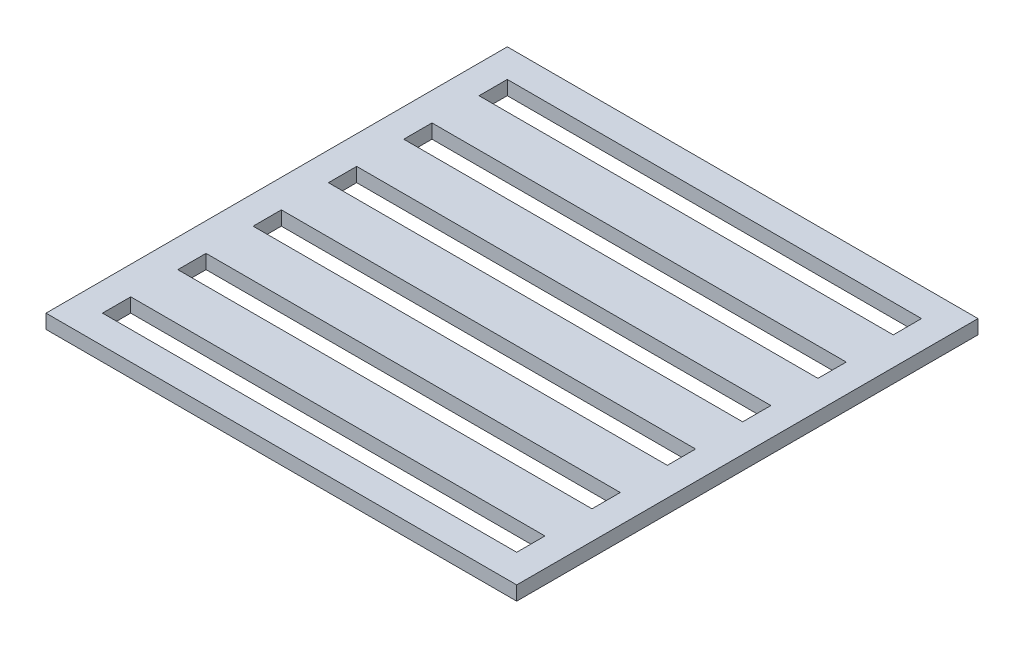
ISO-10303-21;
HEADER;
FILE_DESCRIPTION(('STEP AP214'),'2;1');
FILE_NAME('part.step','',(''),(''),'','','');
FILE_SCHEMA(('AUTOMOTIVE_DESIGN { 1 0 10303 214 1 1 1 1 }'));
ENDSEC;
DATA;
#1=APPLICATION_CONTEXT('core data for automotive mechanical design processes');
#2=APPLICATION_PROTOCOL_DEFINITION('international standard','automotive_design',2000,#1);
#3=PRODUCT_CONTEXT('',#1,'mechanical');
#4=PRODUCT('Part','Part','',(#3));
#5=PRODUCT_RELATED_PRODUCT_CATEGORY('part','',(#4));
#6=PRODUCT_DEFINITION_FORMATION('','',#4);
#7=PRODUCT_DEFINITION_CONTEXT('part definition',#1,'design');
#8=PRODUCT_DEFINITION('design','',#6,#7);
#9=PRODUCT_DEFINITION_SHAPE('','',#8);
#10=(LENGTH_UNIT() NAMED_UNIT(*) SI_UNIT(.MILLI.,.METRE.));
#11=(NAMED_UNIT(*) PLANE_ANGLE_UNIT() SI_UNIT($,.RADIAN.));
#12=(NAMED_UNIT(*) SI_UNIT($,.STERADIAN.) SOLID_ANGLE_UNIT());
#13=UNCERTAINTY_MEASURE_WITH_UNIT(LENGTH_MEASURE(1.E-05),#10,'distance_accuracy_value','');
#14=(GEOMETRIC_REPRESENTATION_CONTEXT(3) GLOBAL_UNCERTAINTY_ASSIGNED_CONTEXT((#13)) GLOBAL_UNIT_ASSIGNED_CONTEXT((#10,
#11,#12)) REPRESENTATION_CONTEXT('',''));
#15=CARTESIAN_POINT('',(0.,0.,0.));
#16=DIRECTION('',(0.,0.,1.));
#17=DIRECTION('',(1.,0.,0.));
#18=AXIS2_PLACEMENT_3D('',#15,#16,#17);
#19=CARTESIAN_POINT('',(500.,-7.50000000000003,245.));
#20=DIRECTION('',(0.,0.,-1.));
#21=DIRECTION('',(-1.,0.,0.));
#22=AXIS2_PLACEMENT_3D('',#19,#20,#21);
#23=PLANE('',#22);
#24=DIRECTION('',(0.,-1.,0.));
#25=VECTOR('',#24,1.);
#26=CARTESIAN_POINT('',(0.,-7.50000000000003,245.));
#27=LINE('',#26,#25);
#28=CARTESIAN_POINT('',(0.,7.49999999999997,245.));
#29=VERTEX_POINT('',#28);
#30=CARTESIAN_POINT('',(0.,-7.50000000000003,245.));
#31=VERTEX_POINT('',#30);
#32=EDGE_CURVE('E276',#29,#31,#27,.T.);
#33=ORIENTED_EDGE('',*,*,#32,.T.);
#34=DIRECTION('',(-1.,0.,0.));
#35=VECTOR('',#34,1.);
#36=CARTESIAN_POINT('',(500.,-7.50000000000003,245.));
#37=LINE('',#36,#35);
#38=CARTESIAN_POINT('',(500.,-7.50000000000003,245.));
#39=VERTEX_POINT('',#38);
#40=EDGE_CURVE('E11',#39,#31,#37,.T.);
#41=ORIENTED_EDGE('',*,*,#40,.F.);
#42=DIRECTION('',(0.,-1.,0.));
#43=VECTOR('',#42,1.);
#44=CARTESIAN_POINT('',(500.,-7.50000000000003,245.));
#45=LINE('',#44,#43);
#46=CARTESIAN_POINT('',(500.,7.49999999999997,245.));
#47=VERTEX_POINT('',#46);
#48=EDGE_CURVE('E499',#47,#39,#45,.T.);
#49=ORIENTED_EDGE('',*,*,#48,.F.);
#50=DIRECTION('',(-1.,0.,0.));
#51=VECTOR('',#50,1.);
#52=CARTESIAN_POINT('',(500.,7.49999999999997,245.));
#53=LINE('',#52,#51);
#54=EDGE_CURVE('E513',#47,#29,#53,.T.);
#55=ORIENTED_EDGE('',*,*,#54,.T.);
#56=EDGE_LOOP('',(#33,#41,#49,#55));
#57=FACE_BOUND('',#56,.T.);
#58=ADVANCED_FACE('F43',(#57),#23,.F.);
#59=CARTESIAN_POINT('',(500.,-7.49999999999997,-245.));
#60=DIRECTION('',(0.,1.,0.));
#61=DIRECTION('',(0.,0.,1.));
#62=AXIS2_PLACEMENT_3D('',#59,#60,#61);
#63=PLANE('',#62);
#64=DIRECTION('',(1.,0.,0.));
#65=VECTOR('',#64,1.);
#66=CARTESIAN_POINT('',(30.,-7.49999999999998,-185.));
#67=LINE('',#66,#65);
#68=CARTESIAN_POINT('',(30.,-7.49999999999998,-185.));
#69=VERTEX_POINT('',#68);
#70=CARTESIAN_POINT('',(470.,-7.49999999999998,-185.));
#71=VERTEX_POINT('',#70);
#72=EDGE_CURVE('E241',#69,#71,#67,.T.);
#73=ORIENTED_EDGE('',*,*,#72,.T.);
#74=DIRECTION('',(0.,0.,-1.));
#75=VECTOR('',#74,1.);
#76=CARTESIAN_POINT('',(470.,-7.49999999999998,-185.));
#77=LINE('',#76,#75);
#78=CARTESIAN_POINT('',(470.,-7.49999999999997,-215.));
#79=VERTEX_POINT('',#78);
#80=EDGE_CURVE('E232',#71,#79,#77,.T.);
#81=ORIENTED_EDGE('',*,*,#80,.T.);
#82=DIRECTION('',(-1.,0.,0.));
#83=VECTOR('',#82,1.);
#84=CARTESIAN_POINT('',(30.,-7.49999999999997,-215.));
#85=LINE('',#84,#83);
#86=CARTESIAN_POINT('',(30.,-7.49999999999997,-215.));
#87=VERTEX_POINT('',#86);
#88=EDGE_CURVE('E244',#79,#87,#85,.T.);
#89=ORIENTED_EDGE('',*,*,#88,.T.);
#90=DIRECTION('',(0.,0.,1.));
#91=VECTOR('',#90,1.);
#92=CARTESIAN_POINT('',(30.,-7.49999999999998,-185.));
#93=LINE('',#92,#91);
#94=EDGE_CURVE('E58',#87,#69,#93,.T.);
#95=ORIENTED_EDGE('',*,*,#94,.T.);
#96=EDGE_LOOP('',(#73,#81,#89,#95));
#97=FACE_BOUND('',#96,.T.);
#98=DIRECTION('',(-1.,0.,0.));
#99=VECTOR('',#98,1.);
#100=CARTESIAN_POINT('',(470.,-7.49999999999998,-135.));
#101=LINE('',#100,#99);
#102=CARTESIAN_POINT('',(470.,-7.49999999999998,-135.));
#103=VERTEX_POINT('',#102);
#104=CARTESIAN_POINT('',(30.,-7.49999999999998,-135.));
#105=VERTEX_POINT('',#104);
#106=EDGE_CURVE('E286',#103,#105,#101,.T.);
#107=ORIENTED_EDGE('',*,*,#106,.T.);
#108=DIRECTION('',(0.,0.,1.));
#109=VECTOR('',#108,1.);
#110=CARTESIAN_POINT('',(30.,-7.49999999999999,-105.));
#111=LINE('',#110,#109);
#112=CARTESIAN_POINT('',(30.,-7.49999999999999,-105.));
#113=VERTEX_POINT('',#112);
#114=EDGE_CURVE('E302',#105,#113,#111,.T.);
#115=ORIENTED_EDGE('',*,*,#114,.T.);
#116=DIRECTION('',(1.,0.,0.));
#117=VECTOR('',#116,1.);
#118=CARTESIAN_POINT('',(470.,-7.49999999999999,-105.));
#119=LINE('',#118,#117);
#120=CARTESIAN_POINT('',(470.,-7.49999999999999,-105.));
#121=VERTEX_POINT('',#120);
#122=EDGE_CURVE('E317',#113,#121,#119,.T.);
#123=ORIENTED_EDGE('',*,*,#122,.T.);
#124=DIRECTION('',(0.,0.,-1.));
#125=VECTOR('',#124,1.);
#126=CARTESIAN_POINT('',(470.,-7.49999999999999,-105.));
#127=LINE('',#126,#125);
#128=EDGE_CURVE('E66',#121,#103,#127,.T.);
#129=ORIENTED_EDGE('',*,*,#128,.T.);
#130=EDGE_LOOP('',(#107,#115,#123,#129));
#131=FACE_BOUND('',#130,.T.);
#132=DIRECTION('',(-1.,0.,0.));
#133=VECTOR('',#132,1.);
#134=CARTESIAN_POINT('',(470.,-7.49999999999999,-55.));
#135=LINE('',#134,#133);
#136=CARTESIAN_POINT('',(470.,-7.49999999999999,-55.));
#137=VERTEX_POINT('',#136);
#138=CARTESIAN_POINT('',(30.,-7.49999999999999,-55.));
#139=VERTEX_POINT('',#138);
#140=EDGE_CURVE('E328',#137,#139,#135,.T.);
#141=ORIENTED_EDGE('',*,*,#140,.T.);
#142=DIRECTION('',(0.,0.,1.));
#143=VECTOR('',#142,1.);
#144=CARTESIAN_POINT('',(30.,-7.5,-25.));
#145=LINE('',#144,#143);
#146=CARTESIAN_POINT('',(30.,-7.5,-25.));
#147=VERTEX_POINT('',#146);
#148=EDGE_CURVE('E344',#139,#147,#145,.T.);
#149=ORIENTED_EDGE('',*,*,#148,.T.);
#150=DIRECTION('',(1.,0.,0.));
#151=VECTOR('',#150,1.);
#152=CARTESIAN_POINT('',(470.,-7.5,-25.));
#153=LINE('',#152,#151);
#154=CARTESIAN_POINT('',(470.,-7.5,-25.));
#155=VERTEX_POINT('',#154);
#156=EDGE_CURVE('E361',#147,#155,#153,.T.);
#157=ORIENTED_EDGE('',*,*,#156,.T.);
#158=DIRECTION('',(0.,0.,-1.));
#159=VECTOR('',#158,1.);
#160=CARTESIAN_POINT('',(470.,-7.5,-25.));
#161=LINE('',#160,#159);
#162=EDGE_CURVE('E357',#155,#137,#161,.T.);
#163=ORIENTED_EDGE('',*,*,#162,.T.);
#164=EDGE_LOOP('',(#141,#149,#157,#163));
#165=FACE_BOUND('',#164,.T.);
#166=DIRECTION('',(-1.,0.,0.));
#167=VECTOR('',#166,1.);
#168=CARTESIAN_POINT('',(470.,-7.5,25.));
#169=LINE('',#168,#167);
#170=CARTESIAN_POINT('',(470.,-7.5,25.));
#171=VERTEX_POINT('',#170);
#172=CARTESIAN_POINT('',(30.,-7.5,25.));
#173=VERTEX_POINT('',#172);
#174=EDGE_CURVE('E372',#171,#173,#169,.T.);
#175=ORIENTED_EDGE('',*,*,#174,.T.);
#176=DIRECTION('',(0.,0.,1.));
#177=VECTOR('',#176,1.);
#178=CARTESIAN_POINT('',(30.,-7.50000000000001,55.));
#179=LINE('',#178,#177);
#180=CARTESIAN_POINT('',(30.,-7.50000000000001,55.));
#181=VERTEX_POINT('',#180);
#182=EDGE_CURVE('E388',#173,#181,#179,.T.);
#183=ORIENTED_EDGE('',*,*,#182,.T.);
#184=DIRECTION('',(1.,0.,0.));
#185=VECTOR('',#184,1.);
#186=CARTESIAN_POINT('',(470.,-7.50000000000001,55.));
#187=LINE('',#186,#185);
#188=CARTESIAN_POINT('',(470.,-7.50000000000001,55.));
#189=VERTEX_POINT('',#188);
#190=EDGE_CURVE('E405',#181,#189,#187,.T.);
#191=ORIENTED_EDGE('',*,*,#190,.T.);
#192=DIRECTION('',(0.,0.,-1.));
#193=VECTOR('',#192,1.);
#194=CARTESIAN_POINT('',(470.,-7.50000000000001,55.));
#195=LINE('',#194,#193);
#196=EDGE_CURVE('E401',#189,#171,#195,.T.);
#197=ORIENTED_EDGE('',*,*,#196,.T.);
#198=EDGE_LOOP('',(#175,#183,#191,#197));
#199=FACE_BOUND('',#198,.T.);
#200=DIRECTION('',(-1.,0.,0.));
#201=VECTOR('',#200,1.);
#202=CARTESIAN_POINT('',(470.,-7.50000000000001,105.));
#203=LINE('',#202,#201);
#204=CARTESIAN_POINT('',(470.,-7.50000000000001,105.));
#205=VERTEX_POINT('',#204);
#206=CARTESIAN_POINT('',(30.,-7.50000000000001,105.));
#207=VERTEX_POINT('',#206);
#208=EDGE_CURVE('E416',#205,#207,#203,.T.);
#209=ORIENTED_EDGE('',*,*,#208,.T.);
#210=DIRECTION('',(0.,0.,1.));
#211=VECTOR('',#210,1.);
#212=CARTESIAN_POINT('',(30.,-7.50000000000002,135.));
#213=LINE('',#212,#211);
#214=CARTESIAN_POINT('',(30.,-7.50000000000002,135.));
#215=VERTEX_POINT('',#214);
#216=EDGE_CURVE('E432',#207,#215,#213,.T.);
#217=ORIENTED_EDGE('',*,*,#216,.T.);
#218=DIRECTION('',(1.,0.,0.));
#219=VECTOR('',#218,1.);
#220=CARTESIAN_POINT('',(470.,-7.50000000000002,135.));
#221=LINE('',#220,#219);
#222=CARTESIAN_POINT('',(470.,-7.50000000000002,135.));
#223=VERTEX_POINT('',#222);
#224=EDGE_CURVE('E449',#215,#223,#221,.T.);
#225=ORIENTED_EDGE('',*,*,#224,.T.);
#226=DIRECTION('',(0.,0.,-1.));
#227=VECTOR('',#226,1.);
#228=CARTESIAN_POINT('',(470.,-7.50000000000002,135.));
#229=LINE('',#228,#227);
#230=EDGE_CURVE('E445',#223,#205,#229,.T.);
#231=ORIENTED_EDGE('',*,*,#230,.T.);
#232=EDGE_LOOP('',(#209,#217,#225,#231));
#233=FACE_BOUND('',#232,.T.);
#234=DIRECTION('',(-1.,0.,0.));
#235=VECTOR('',#234,1.);
#236=CARTESIAN_POINT('',(470.,-7.50000000000002,185.));
#237=LINE('',#236,#235);
#238=CARTESIAN_POINT('',(470.,-7.50000000000002,185.));
#239=VERTEX_POINT('',#238);
#240=CARTESIAN_POINT('',(30.,-7.50000000000002,185.));
#241=VERTEX_POINT('',#240);
#242=EDGE_CURVE('E460',#239,#241,#237,.T.);
#243=ORIENTED_EDGE('',*,*,#242,.T.);
#244=DIRECTION('',(0.,0.,1.));
#245=VECTOR('',#244,1.);
#246=CARTESIAN_POINT('',(30.,-7.50000000000003,215.));
#247=LINE('',#246,#245);
#248=CARTESIAN_POINT('',(30.,-7.50000000000003,215.));
#249=VERTEX_POINT('',#248);
#250=EDGE_CURVE('E475',#241,#249,#247,.T.);
#251=ORIENTED_EDGE('',*,*,#250,.T.);
#252=DIRECTION('',(1.,0.,0.));
#253=VECTOR('',#252,1.);
#254=CARTESIAN_POINT('',(470.,-7.50000000000003,215.));
#255=LINE('',#254,#253);
#256=CARTESIAN_POINT('',(470.,-7.50000000000003,215.));
#257=VERTEX_POINT('',#256);
#258=EDGE_CURVE('E492',#249,#257,#255,.T.);
#259=ORIENTED_EDGE('',*,*,#258,.T.);
#260=DIRECTION('',(0.,0.,-1.));
#261=VECTOR('',#260,1.);
#262=CARTESIAN_POINT('',(470.,-7.50000000000003,215.));
#263=LINE('',#262,#261);
#264=EDGE_CURVE('E488',#257,#239,#263,.T.);
#265=ORIENTED_EDGE('',*,*,#264,.T.);
#266=EDGE_LOOP('',(#243,#251,#259,#265));
#267=FACE_BOUND('',#266,.T.);
#268=DIRECTION('',(0.,0.,-1.));
#269=VECTOR('',#268,1.);
#270=CARTESIAN_POINT('',(0.,-7.49999999999997,-245.));
#271=LINE('',#270,#269);
#272=CARTESIAN_POINT('',(0.,-7.49999999999997,-245.));
#273=VERTEX_POINT('',#272);
#274=EDGE_CURVE('E517',#31,#273,#271,.T.);
#275=ORIENTED_EDGE('',*,*,#274,.T.);
#276=DIRECTION('',(-1.,0.,0.));
#277=VECTOR('',#276,1.);
#278=CARTESIAN_POINT('',(500.,-7.49999999999997,-245.));
#279=LINE('',#278,#277);
#280=CARTESIAN_POINT('',(500.,-7.49999999999997,-245.));
#281=VERTEX_POINT('',#280);
#282=EDGE_CURVE('E51',#281,#273,#279,.T.);
#283=ORIENTED_EDGE('',*,*,#282,.F.);
#284=DIRECTION('',(0.,0.,-1.));
#285=VECTOR('',#284,1.);
#286=CARTESIAN_POINT('',(500.,-7.49999999999997,-245.));
#287=LINE('',#286,#285);
#288=EDGE_CURVE('E503',#39,#281,#287,.T.);
#289=ORIENTED_EDGE('',*,*,#288,.F.);
#290=ORIENTED_EDGE('',*,*,#40,.T.);
#291=EDGE_LOOP('',(#275,#283,#289,#290));
#292=FACE_BOUND('',#291,.T.);
#293=ADVANCED_FACE('F249',(#97,#131,#165,#199,#233,#267,#292),#63,.F.);
#294=CARTESIAN_POINT('',(500.,-7.49999999999997,-245.));
#295=DIRECTION('',(0.,0.,1.));
#296=DIRECTION('',(1.,0.,0.));
#297=AXIS2_PLACEMENT_3D('',#294,#295,#296);
#298=PLANE('',#297);
#299=DIRECTION('',(0.,1.,0.));
#300=VECTOR('',#299,1.);
#301=CARTESIAN_POINT('',(0.,-7.49999999999997,-245.));
#302=LINE('',#301,#300);
#303=CARTESIAN_POINT('',(0.,7.50000000000003,-245.));
#304=VERTEX_POINT('',#303);
#305=EDGE_CURVE('E520',#273,#304,#302,.T.);
#306=ORIENTED_EDGE('',*,*,#305,.T.);
#307=DIRECTION('',(-1.,0.,0.));
#308=VECTOR('',#307,1.);
#309=CARTESIAN_POINT('',(500.,7.50000000000003,-245.));
#310=LINE('',#309,#308);
#311=CARTESIAN_POINT('',(500.,7.50000000000003,-245.));
#312=VERTEX_POINT('',#311);
#313=EDGE_CURVE('E528',#312,#304,#310,.T.);
#314=ORIENTED_EDGE('',*,*,#313,.F.);
#315=DIRECTION('',(0.,1.,0.));
#316=VECTOR('',#315,1.);
#317=CARTESIAN_POINT('',(500.,-7.49999999999997,-245.));
#318=LINE('',#317,#316);
#319=EDGE_CURVE('E507',#281,#312,#318,.T.);
#320=ORIENTED_EDGE('',*,*,#319,.F.);
#321=ORIENTED_EDGE('',*,*,#282,.T.);
#322=EDGE_LOOP('',(#306,#314,#320,#321));
#323=FACE_BOUND('',#322,.T.);
#324=ADVANCED_FACE('F537',(#323),#298,.F.);
#325=CARTESIAN_POINT('',(500.,7.50000000000003,-245.));
#326=DIRECTION('',(0.,-1.,0.));
#327=DIRECTION('',(0.,0.,-1.));
#328=AXIS2_PLACEMENT_3D('',#325,#326,#327);
#329=PLANE('',#328);
#330=DIRECTION('',(-1.,0.,0.));
#331=VECTOR('',#330,1.);
#332=CARTESIAN_POINT('',(30.,7.50000000000003,-215.));
#333=LINE('',#332,#331);
#334=CARTESIAN_POINT('',(470.,7.50000000000003,-215.));
#335=VERTEX_POINT('',#334);
#336=CARTESIAN_POINT('',(30.,7.50000000000003,-215.));
#337=VERTEX_POINT('',#336);
#338=EDGE_CURVE('E266',#335,#337,#333,.T.);
#339=ORIENTED_EDGE('',*,*,#338,.F.);
#340=DIRECTION('',(0.,0.,-1.));
#341=VECTOR('',#340,1.);
#342=CARTESIAN_POINT('',(470.,7.50000000000002,-185.));
#343=LINE('',#342,#341);
#344=CARTESIAN_POINT('',(470.,7.50000000000002,-185.));
#345=VERTEX_POINT('',#344);
#346=EDGE_CURVE('E235',#345,#335,#343,.T.);
#347=ORIENTED_EDGE('',*,*,#346,.F.);
#348=DIRECTION('',(1.,0.,0.));
#349=VECTOR('',#348,1.);
#350=CARTESIAN_POINT('',(30.,7.50000000000002,-185.));
#351=LINE('',#350,#349);
#352=CARTESIAN_POINT('',(30.,7.50000000000002,-185.));
#353=VERTEX_POINT('',#352);
#354=EDGE_CURVE('E253',#353,#345,#351,.T.);
#355=ORIENTED_EDGE('',*,*,#354,.F.);
#356=DIRECTION('',(0.,0.,1.));
#357=VECTOR('',#356,1.);
#358=CARTESIAN_POINT('',(30.,7.50000000000002,-185.));
#359=LINE('',#358,#357);
#360=EDGE_CURVE('E257',#337,#353,#359,.T.);
#361=ORIENTED_EDGE('',*,*,#360,.F.);
#362=EDGE_LOOP('',(#339,#347,#355,#361));
#363=FACE_BOUND('',#362,.T.);
#364=DIRECTION('',(1.,0.,0.));
#365=VECTOR('',#364,1.);
#366=CARTESIAN_POINT('',(470.,7.50000000000001,-105.));
#367=LINE('',#366,#365);
#368=CARTESIAN_POINT('',(30.,7.50000000000001,-105.));
#369=VERTEX_POINT('',#368);
#370=CARTESIAN_POINT('',(470.,7.50000000000001,-105.));
#371=VERTEX_POINT('',#370);
#372=EDGE_CURVE('E306',#369,#371,#367,.T.);
#373=ORIENTED_EDGE('',*,*,#372,.F.);
#374=DIRECTION('',(0.,0.,1.));
#375=VECTOR('',#374,1.);
#376=CARTESIAN_POINT('',(30.,7.50000000000001,-105.));
#377=LINE('',#376,#375);
#378=CARTESIAN_POINT('',(30.,7.50000000000002,-135.));
#379=VERTEX_POINT('',#378);
#380=EDGE_CURVE('E267',#379,#369,#377,.T.);
#381=ORIENTED_EDGE('',*,*,#380,.F.);
#382=DIRECTION('',(-1.,0.,0.));
#383=VECTOR('',#382,1.);
#384=CARTESIAN_POINT('',(470.,7.50000000000002,-135.));
#385=LINE('',#384,#383);
#386=CARTESIAN_POINT('',(470.,7.50000000000002,-135.));
#387=VERTEX_POINT('',#386);
#388=EDGE_CURVE('E297',#387,#379,#385,.T.);
#389=ORIENTED_EDGE('',*,*,#388,.F.);
#390=DIRECTION('',(0.,0.,-1.));
#391=VECTOR('',#390,1.);
#392=CARTESIAN_POINT('',(470.,7.50000000000001,-105.));
#393=LINE('',#392,#391);
#394=EDGE_CURVE('E301',#371,#387,#393,.T.);
#395=ORIENTED_EDGE('',*,*,#394,.F.);
#396=EDGE_LOOP('',(#373,#381,#389,#395));
#397=FACE_BOUND('',#396,.T.);
#398=DIRECTION('',(1.,0.,0.));
#399=VECTOR('',#398,1.);
#400=CARTESIAN_POINT('',(470.,7.5,-25.));
#401=LINE('',#400,#399);
#402=CARTESIAN_POINT('',(30.,7.5,-25.));
#403=VERTEX_POINT('',#402);
#404=CARTESIAN_POINT('',(470.,7.5,-25.));
#405=VERTEX_POINT('',#404);
#406=EDGE_CURVE('E348',#403,#405,#401,.T.);
#407=ORIENTED_EDGE('',*,*,#406,.F.);
#408=DIRECTION('',(0.,0.,1.));
#409=VECTOR('',#408,1.);
#410=CARTESIAN_POINT('',(30.,7.5,-25.));
#411=LINE('',#410,#409);
#412=CARTESIAN_POINT('',(30.,7.50000000000001,-55.));
#413=VERTEX_POINT('',#412);
#414=EDGE_CURVE('E296',#413,#403,#411,.T.);
#415=ORIENTED_EDGE('',*,*,#414,.F.);
#416=DIRECTION('',(-1.,0.,0.));
#417=VECTOR('',#416,1.);
#418=CARTESIAN_POINT('',(470.,7.50000000000001,-55.));
#419=LINE('',#418,#417);
#420=CARTESIAN_POINT('',(470.,7.50000000000001,-55.));
#421=VERTEX_POINT('',#420);
#422=EDGE_CURVE('E339',#421,#413,#419,.T.);
#423=ORIENTED_EDGE('',*,*,#422,.F.);
#424=DIRECTION('',(0.,0.,-1.));
#425=VECTOR('',#424,1.);
#426=CARTESIAN_POINT('',(470.,7.5,-25.));
#427=LINE('',#426,#425);
#428=EDGE_CURVE('E343',#405,#421,#427,.T.);
#429=ORIENTED_EDGE('',*,*,#428,.F.);
#430=EDGE_LOOP('',(#407,#415,#423,#429));
#431=FACE_BOUND('',#430,.T.);
#432=DIRECTION('',(1.,0.,0.));
#433=VECTOR('',#432,1.);
#434=CARTESIAN_POINT('',(470.,7.49999999999999,55.));
#435=LINE('',#434,#433);
#436=CARTESIAN_POINT('',(30.,7.49999999999999,55.0000000000001));
#437=VERTEX_POINT('',#436);
#438=CARTESIAN_POINT('',(470.,7.49999999999999,55.));
#439=VERTEX_POINT('',#438);
#440=EDGE_CURVE('E392',#437,#439,#435,.T.);
#441=ORIENTED_EDGE('',*,*,#440,.F.);
#442=DIRECTION('',(0.,0.,1.));
#443=VECTOR('',#442,1.);
#444=CARTESIAN_POINT('',(30.,7.49999999999999,55.));
#445=LINE('',#444,#443);
#446=CARTESIAN_POINT('',(30.,7.5,25.));
#447=VERTEX_POINT('',#446);
#448=EDGE_CURVE('E338',#447,#437,#445,.T.);
#449=ORIENTED_EDGE('',*,*,#448,.F.);
#450=DIRECTION('',(-1.,0.,0.));
#451=VECTOR('',#450,1.);
#452=CARTESIAN_POINT('',(470.,7.5,25.));
#453=LINE('',#452,#451);
#454=CARTESIAN_POINT('',(470.,7.5,25.));
#455=VERTEX_POINT('',#454);
#456=EDGE_CURVE('E383',#455,#447,#453,.T.);
#457=ORIENTED_EDGE('',*,*,#456,.F.);
#458=DIRECTION('',(0.,0.,-1.));
#459=VECTOR('',#458,1.);
#460=CARTESIAN_POINT('',(470.,7.49999999999999,55.));
#461=LINE('',#460,#459);
#462=EDGE_CURVE('E387',#439,#455,#461,.T.);
#463=ORIENTED_EDGE('',*,*,#462,.F.);
#464=EDGE_LOOP('',(#441,#449,#457,#463));
#465=FACE_BOUND('',#464,.T.);
#466=DIRECTION('',(1.,0.,0.));
#467=VECTOR('',#466,1.);
#468=CARTESIAN_POINT('',(470.,7.49999999999998,135.));
#469=LINE('',#468,#467);
#470=CARTESIAN_POINT('',(30.,7.49999999999998,135.));
#471=VERTEX_POINT('',#470);
#472=CARTESIAN_POINT('',(470.,7.49999999999998,135.));
#473=VERTEX_POINT('',#472);
#474=EDGE_CURVE('E436',#471,#473,#469,.T.);
#475=ORIENTED_EDGE('',*,*,#474,.F.);
#476=DIRECTION('',(0.,0.,1.));
#477=VECTOR('',#476,1.);
#478=CARTESIAN_POINT('',(30.,7.49999999999998,135.));
#479=LINE('',#478,#477);
#480=CARTESIAN_POINT('',(30.,7.49999999999999,105.));
#481=VERTEX_POINT('',#480);
#482=EDGE_CURVE('E382',#481,#471,#479,.T.);
#483=ORIENTED_EDGE('',*,*,#482,.F.);
#484=DIRECTION('',(-1.,0.,0.));
#485=VECTOR('',#484,1.);
#486=CARTESIAN_POINT('',(470.,7.49999999999999,105.));
#487=LINE('',#486,#485);
#488=CARTESIAN_POINT('',(470.,7.49999999999999,105.));
#489=VERTEX_POINT('',#488);
#490=EDGE_CURVE('E427',#489,#481,#487,.T.);
#491=ORIENTED_EDGE('',*,*,#490,.F.);
#492=DIRECTION('',(0.,0.,-1.));
#493=VECTOR('',#492,1.);
#494=CARTESIAN_POINT('',(470.,7.49999999999998,135.));
#495=LINE('',#494,#493);
#496=EDGE_CURVE('E431',#473,#489,#495,.T.);
#497=ORIENTED_EDGE('',*,*,#496,.F.);
#498=EDGE_LOOP('',(#475,#483,#491,#497));
#499=FACE_BOUND('',#498,.T.);
#500=DIRECTION('',(1.,0.,0.));
#501=VECTOR('',#500,1.);
#502=CARTESIAN_POINT('',(470.,7.49999999999997,215.));
#503=LINE('',#502,#501);
#504=CARTESIAN_POINT('',(29.9999999999999,7.49999999999997,215.));
#505=VERTEX_POINT('',#504);
#506=CARTESIAN_POINT('',(470.,7.49999999999997,215.));
#507=VERTEX_POINT('',#506);
#508=EDGE_CURVE('E479',#505,#507,#503,.T.);
#509=ORIENTED_EDGE('',*,*,#508,.F.);
#510=DIRECTION('',(0.,0.,1.));
#511=VECTOR('',#510,1.);
#512=CARTESIAN_POINT('',(30.,7.49999999999997,215.));
#513=LINE('',#512,#511);
#514=CARTESIAN_POINT('',(30.,7.49999999999998,185.));
#515=VERTEX_POINT('',#514);
#516=EDGE_CURVE('E426',#515,#505,#513,.T.);
#517=ORIENTED_EDGE('',*,*,#516,.F.);
#518=DIRECTION('',(-1.,0.,0.));
#519=VECTOR('',#518,1.);
#520=CARTESIAN_POINT('',(470.,7.49999999999998,185.));
#521=LINE('',#520,#519);
#522=CARTESIAN_POINT('',(470.,7.49999999999998,185.));
#523=VERTEX_POINT('',#522);
#524=EDGE_CURVE('E470',#523,#515,#521,.T.);
#525=ORIENTED_EDGE('',*,*,#524,.F.);
#526=DIRECTION('',(0.,0.,-1.));
#527=VECTOR('',#526,1.);
#528=CARTESIAN_POINT('',(470.,7.49999999999997,215.));
#529=LINE('',#528,#527);
#530=EDGE_CURVE('E474',#507,#523,#529,.T.);
#531=ORIENTED_EDGE('',*,*,#530,.F.);
#532=EDGE_LOOP('',(#509,#517,#525,#531));
#533=FACE_BOUND('',#532,.T.);
#534=DIRECTION('',(0.,0.,1.));
#535=VECTOR('',#534,1.);
#536=CARTESIAN_POINT('',(0.,7.50000000000003,-245.));
#537=LINE('',#536,#535);
#538=EDGE_CURVE('E504',#304,#29,#537,.T.);
#539=ORIENTED_EDGE('',*,*,#538,.T.);
#540=ORIENTED_EDGE('',*,*,#54,.F.);
#541=DIRECTION('',(0.,0.,1.));
#542=VECTOR('',#541,1.);
#543=CARTESIAN_POINT('',(500.,7.50000000000003,-245.));
#544=LINE('',#543,#542);
#545=EDGE_CURVE('E510',#312,#47,#544,.T.);
#546=ORIENTED_EDGE('',*,*,#545,.F.);
#547=ORIENTED_EDGE('',*,*,#313,.T.);
#548=EDGE_LOOP('',(#539,#540,#546,#547));
#549=FACE_BOUND('',#548,.T.);
#550=ADVANCED_FACE('F546',(#363,#397,#431,#465,#499,#533,#549),#329,.F.);
#551=CARTESIAN_POINT('',(500.,0.,0.));
#552=DIRECTION('',(1.,0.,0.));
#553=DIRECTION('',(0.,0.,-1.));
#554=AXIS2_PLACEMENT_3D('',#551,#552,#553);
#555=PLANE('',#554);
#556=ORIENTED_EDGE('',*,*,#48,.T.);
#557=ORIENTED_EDGE('',*,*,#288,.T.);
#558=ORIENTED_EDGE('',*,*,#319,.T.);
#559=ORIENTED_EDGE('',*,*,#545,.T.);
#560=EDGE_LOOP('',(#556,#557,#558,#559));
#561=FACE_BOUND('',#560,.T.);
#562=ADVANCED_FACE('F552',(#561),#555,.T.);
#563=CARTESIAN_POINT('',(0.,0.,0.));
#564=DIRECTION('',(1.,0.,0.));
#565=DIRECTION('',(0.,0.,-1.));
#566=AXIS2_PLACEMENT_3D('',#563,#564,#565);
#567=PLANE('',#566);
#568=ORIENTED_EDGE('',*,*,#32,.F.);
#569=ORIENTED_EDGE('',*,*,#538,.F.);
#570=ORIENTED_EDGE('',*,*,#305,.F.);
#571=ORIENTED_EDGE('',*,*,#274,.F.);
#572=EDGE_LOOP('',(#568,#569,#570,#571));
#573=FACE_BOUND('',#572,.T.);
#574=ADVANCED_FACE('F543',(#573),#567,.F.);
#575=CARTESIAN_POINT('',(30.,-7.50000000000003,215.));
#576=DIRECTION('',(-1.,0.,0.));
#577=DIRECTION('',(0.,0.,1.));
#578=AXIS2_PLACEMENT_3D('',#575,#576,#577);
#579=PLANE('',#578);
#580=ORIENTED_EDGE('',*,*,#516,.T.);
#581=DIRECTION('',(0.,1.,0.));
#582=VECTOR('',#581,1.);
#583=CARTESIAN_POINT('',(30.,-7.50000000000003,215.));
#584=LINE('',#583,#582);
#585=EDGE_CURVE('E456',#249,#505,#584,.T.);
#586=ORIENTED_EDGE('',*,*,#585,.F.);
#587=ORIENTED_EDGE('',*,*,#250,.F.);
#588=DIRECTION('',(0.,1.,0.));
#589=VECTOR('',#588,1.);
#590=CARTESIAN_POINT('',(30.,-7.50000000000002,185.));
#591=LINE('',#590,#589);
#592=EDGE_CURVE('E467',#241,#515,#591,.T.);
#593=ORIENTED_EDGE('',*,*,#592,.T.);
#594=EDGE_LOOP('',(#580,#586,#587,#593));
#595=FACE_BOUND('',#594,.T.);
#596=ADVANCED_FACE('F565',(#595),#579,.F.);
#597=CARTESIAN_POINT('',(470.,-7.50000000000002,185.));
#598=DIRECTION('',(0.,0.,-1.));
#599=DIRECTION('',(-1.,0.,0.));
#600=AXIS2_PLACEMENT_3D('',#597,#598,#599);
#601=PLANE('',#600);
#602=ORIENTED_EDGE('',*,*,#524,.T.);
#603=ORIENTED_EDGE('',*,*,#592,.F.);
#604=ORIENTED_EDGE('',*,*,#242,.F.);
#605=DIRECTION('',(0.,1.,0.));
#606=VECTOR('',#605,1.);
#607=CARTESIAN_POINT('',(470.,-7.50000000000002,185.));
#608=LINE('',#607,#606);
#609=EDGE_CURVE('E464',#239,#523,#608,.T.);
#610=ORIENTED_EDGE('',*,*,#609,.T.);
#611=EDGE_LOOP('',(#602,#603,#604,#610));
#612=FACE_BOUND('',#611,.T.);
#613=ADVANCED_FACE('F568',(#612),#601,.F.);
#614=CARTESIAN_POINT('',(470.,-7.50000000000003,215.));
#615=DIRECTION('',(1.,0.,0.));
#616=DIRECTION('',(0.,0.,-1.));
#617=AXIS2_PLACEMENT_3D('',#614,#615,#616);
#618=PLANE('',#617);
#619=ORIENTED_EDGE('',*,*,#530,.T.);
#620=ORIENTED_EDGE('',*,*,#609,.F.);
#621=ORIENTED_EDGE('',*,*,#264,.F.);
#622=DIRECTION('',(0.,1.,0.));
#623=VECTOR('',#622,1.);
#624=CARTESIAN_POINT('',(470.,-7.50000000000003,215.));
#625=LINE('',#624,#623);
#626=EDGE_CURVE('E461',#257,#507,#625,.T.);
#627=ORIENTED_EDGE('',*,*,#626,.T.);
#628=EDGE_LOOP('',(#619,#620,#621,#627));
#629=FACE_BOUND('',#628,.T.);
#630=ADVANCED_FACE('F571',(#629),#618,.F.);
#631=CARTESIAN_POINT('',(470.,-7.50000000000003,215.));
#632=DIRECTION('',(0.,0.,1.));
#633=DIRECTION('',(1.,0.,0.));
#634=AXIS2_PLACEMENT_3D('',#631,#632,#633);
#635=PLANE('',#634);
#636=ORIENTED_EDGE('',*,*,#508,.T.);
#637=ORIENTED_EDGE('',*,*,#626,.F.);
#638=ORIENTED_EDGE('',*,*,#258,.F.);
#639=ORIENTED_EDGE('',*,*,#585,.T.);
#640=EDGE_LOOP('',(#636,#637,#638,#639));
#641=FACE_BOUND('',#640,.T.);
#642=ADVANCED_FACE('F575',(#641),#635,.F.);
#643=CARTESIAN_POINT('',(30.,-7.50000000000002,135.));
#644=DIRECTION('',(-1.,0.,0.));
#645=DIRECTION('',(0.,0.,1.));
#646=AXIS2_PLACEMENT_3D('',#643,#644,#645);
#647=PLANE('',#646);
#648=ORIENTED_EDGE('',*,*,#482,.T.);
#649=DIRECTION('',(0.,1.,0.));
#650=VECTOR('',#649,1.);
#651=CARTESIAN_POINT('',(30.,-7.50000000000002,135.));
#652=LINE('',#651,#650);
#653=EDGE_CURVE('E412',#215,#471,#652,.T.);
#654=ORIENTED_EDGE('',*,*,#653,.F.);
#655=ORIENTED_EDGE('',*,*,#216,.F.);
#656=DIRECTION('',(0.,1.,0.));
#657=VECTOR('',#656,1.);
#658=CARTESIAN_POINT('',(30.,-7.50000000000001,105.));
#659=LINE('',#658,#657);
#660=EDGE_CURVE('E423',#207,#481,#659,.T.);
#661=ORIENTED_EDGE('',*,*,#660,.T.);
#662=EDGE_LOOP('',(#648,#654,#655,#661));
#663=FACE_BOUND('',#662,.T.);
#664=ADVANCED_FACE('F579',(#663),#647,.F.);
#665=CARTESIAN_POINT('',(470.,-7.50000000000001,105.));
#666=DIRECTION('',(0.,0.,-1.));
#667=DIRECTION('',(-1.,0.,0.));
#668=AXIS2_PLACEMENT_3D('',#665,#666,#667);
#669=PLANE('',#668);
#670=ORIENTED_EDGE('',*,*,#490,.T.);
#671=ORIENTED_EDGE('',*,*,#660,.F.);
#672=ORIENTED_EDGE('',*,*,#208,.F.);
#673=DIRECTION('',(0.,1.,0.));
#674=VECTOR('',#673,1.);
#675=CARTESIAN_POINT('',(470.,-7.50000000000001,105.));
#676=LINE('',#675,#674);
#677=EDGE_CURVE('E420',#205,#489,#676,.T.);
#678=ORIENTED_EDGE('',*,*,#677,.T.);
#679=EDGE_LOOP('',(#670,#671,#672,#678));
#680=FACE_BOUND('',#679,.T.);
#681=ADVANCED_FACE('F584',(#680),#669,.F.);
#682=CARTESIAN_POINT('',(470.,-7.50000000000002,135.));
#683=DIRECTION('',(1.,0.,0.));
#684=DIRECTION('',(0.,0.,-1.));
#685=AXIS2_PLACEMENT_3D('',#682,#683,#684);
#686=PLANE('',#685);
#687=ORIENTED_EDGE('',*,*,#496,.T.);
#688=ORIENTED_EDGE('',*,*,#677,.F.);
#689=ORIENTED_EDGE('',*,*,#230,.F.);
#690=DIRECTION('',(0.,1.,0.));
#691=VECTOR('',#690,1.);
#692=CARTESIAN_POINT('',(470.,-7.50000000000002,135.));
#693=LINE('',#692,#691);
#694=EDGE_CURVE('E417',#223,#473,#693,.T.);
#695=ORIENTED_EDGE('',*,*,#694,.T.);
#696=EDGE_LOOP('',(#687,#688,#689,#695));
#697=FACE_BOUND('',#696,.T.);
#698=ADVANCED_FACE('F587',(#697),#686,.F.);
#699=CARTESIAN_POINT('',(470.,-7.50000000000002,135.));
#700=DIRECTION('',(0.,0.,1.));
#701=DIRECTION('',(1.,0.,0.));
#702=AXIS2_PLACEMENT_3D('',#699,#700,#701);
#703=PLANE('',#702);
#704=ORIENTED_EDGE('',*,*,#474,.T.);
#705=ORIENTED_EDGE('',*,*,#694,.F.);
#706=ORIENTED_EDGE('',*,*,#224,.F.);
#707=ORIENTED_EDGE('',*,*,#653,.T.);
#708=EDGE_LOOP('',(#704,#705,#706,#707));
#709=FACE_BOUND('',#708,.T.);
#710=ADVANCED_FACE('F591',(#709),#703,.F.);
#711=CARTESIAN_POINT('',(30.,-7.50000000000001,55.));
#712=DIRECTION('',(-1.,0.,0.));
#713=DIRECTION('',(0.,0.,1.));
#714=AXIS2_PLACEMENT_3D('',#711,#712,#713);
#715=PLANE('',#714);
#716=ORIENTED_EDGE('',*,*,#448,.T.);
#717=DIRECTION('',(0.,1.,0.));
#718=VECTOR('',#717,1.);
#719=CARTESIAN_POINT('',(30.,-7.50000000000001,55.));
#720=LINE('',#719,#718);
#721=EDGE_CURVE('E368',#181,#437,#720,.T.);
#722=ORIENTED_EDGE('',*,*,#721,.F.);
#723=ORIENTED_EDGE('',*,*,#182,.F.);
#724=DIRECTION('',(0.,1.,0.));
#725=VECTOR('',#724,1.);
#726=CARTESIAN_POINT('',(30.,-7.5,25.));
#727=LINE('',#726,#725);
#728=EDGE_CURVE('E379',#173,#447,#727,.T.);
#729=ORIENTED_EDGE('',*,*,#728,.T.);
#730=EDGE_LOOP('',(#716,#722,#723,#729));
#731=FACE_BOUND('',#730,.T.);
#732=ADVANCED_FACE('F595',(#731),#715,.F.);
#733=CARTESIAN_POINT('',(470.,-7.5,25.));
#734=DIRECTION('',(0.,0.,-1.));
#735=DIRECTION('',(-1.,0.,0.));
#736=AXIS2_PLACEMENT_3D('',#733,#734,#735);
#737=PLANE('',#736);
#738=ORIENTED_EDGE('',*,*,#456,.T.);
#739=ORIENTED_EDGE('',*,*,#728,.F.);
#740=ORIENTED_EDGE('',*,*,#174,.F.);
#741=DIRECTION('',(0.,1.,0.));
#742=VECTOR('',#741,1.);
#743=CARTESIAN_POINT('',(470.,-7.5,25.));
#744=LINE('',#743,#742);
#745=EDGE_CURVE('E376',#171,#455,#744,.T.);
#746=ORIENTED_EDGE('',*,*,#745,.T.);
#747=EDGE_LOOP('',(#738,#739,#740,#746));
#748=FACE_BOUND('',#747,.T.);
#749=ADVANCED_FACE('F600',(#748),#737,.F.);
#750=CARTESIAN_POINT('',(470.,-7.50000000000001,55.));
#751=DIRECTION('',(1.,0.,0.));
#752=DIRECTION('',(0.,0.,-1.));
#753=AXIS2_PLACEMENT_3D('',#750,#751,#752);
#754=PLANE('',#753);
#755=ORIENTED_EDGE('',*,*,#462,.T.);
#756=ORIENTED_EDGE('',*,*,#745,.F.);
#757=ORIENTED_EDGE('',*,*,#196,.F.);
#758=DIRECTION('',(0.,1.,0.));
#759=VECTOR('',#758,1.);
#760=CARTESIAN_POINT('',(470.,-7.50000000000001,55.));
#761=LINE('',#760,#759);
#762=EDGE_CURVE('E373',#189,#439,#761,.T.);
#763=ORIENTED_EDGE('',*,*,#762,.T.);
#764=EDGE_LOOP('',(#755,#756,#757,#763));
#765=FACE_BOUND('',#764,.T.);
#766=ADVANCED_FACE('F603',(#765),#754,.F.);
#767=CARTESIAN_POINT('',(470.,-7.50000000000001,55.));
#768=DIRECTION('',(0.,0.,1.));
#769=DIRECTION('',(1.,0.,0.));
#770=AXIS2_PLACEMENT_3D('',#767,#768,#769);
#771=PLANE('',#770);
#772=ORIENTED_EDGE('',*,*,#440,.T.);
#773=ORIENTED_EDGE('',*,*,#762,.F.);
#774=ORIENTED_EDGE('',*,*,#190,.F.);
#775=ORIENTED_EDGE('',*,*,#721,.T.);
#776=EDGE_LOOP('',(#772,#773,#774,#775));
#777=FACE_BOUND('',#776,.T.);
#778=ADVANCED_FACE('F607',(#777),#771,.F.);
#779=CARTESIAN_POINT('',(30.,-7.5,-25.));
#780=DIRECTION('',(-1.,0.,0.));
#781=DIRECTION('',(0.,0.,1.));
#782=AXIS2_PLACEMENT_3D('',#779,#780,#781);
#783=PLANE('',#782);
#784=ORIENTED_EDGE('',*,*,#414,.T.);
#785=DIRECTION('',(0.,1.,0.));
#786=VECTOR('',#785,1.);
#787=CARTESIAN_POINT('',(30.,-7.5,-25.));
#788=LINE('',#787,#786);
#789=EDGE_CURVE('E324',#147,#403,#788,.T.);
#790=ORIENTED_EDGE('',*,*,#789,.F.);
#791=ORIENTED_EDGE('',*,*,#148,.F.);
#792=DIRECTION('',(0.,1.,0.));
#793=VECTOR('',#792,1.);
#794=CARTESIAN_POINT('',(30.,-7.49999999999999,-55.));
#795=LINE('',#794,#793);
#796=EDGE_CURVE('E335',#139,#413,#795,.T.);
#797=ORIENTED_EDGE('',*,*,#796,.T.);
#798=EDGE_LOOP('',(#784,#790,#791,#797));
#799=FACE_BOUND('',#798,.T.);
#800=ADVANCED_FACE('F611',(#799),#783,.F.);
#801=CARTESIAN_POINT('',(470.,-7.49999999999999,-55.));
#802=DIRECTION('',(0.,0.,-1.));
#803=DIRECTION('',(-1.,0.,0.));
#804=AXIS2_PLACEMENT_3D('',#801,#802,#803);
#805=PLANE('',#804);
#806=ORIENTED_EDGE('',*,*,#422,.T.);
#807=ORIENTED_EDGE('',*,*,#796,.F.);
#808=ORIENTED_EDGE('',*,*,#140,.F.);
#809=DIRECTION('',(0.,1.,0.));
#810=VECTOR('',#809,1.);
#811=CARTESIAN_POINT('',(470.,-7.49999999999999,-55.));
#812=LINE('',#811,#810);
#813=EDGE_CURVE('E332',#137,#421,#812,.T.);
#814=ORIENTED_EDGE('',*,*,#813,.T.);
#815=EDGE_LOOP('',(#806,#807,#808,#814));
#816=FACE_BOUND('',#815,.T.);
#817=ADVANCED_FACE('F616',(#816),#805,.F.);
#818=CARTESIAN_POINT('',(470.,-7.5,-25.));
#819=DIRECTION('',(1.,0.,0.));
#820=DIRECTION('',(0.,0.,-1.));
#821=AXIS2_PLACEMENT_3D('',#818,#819,#820);
#822=PLANE('',#821);
#823=ORIENTED_EDGE('',*,*,#428,.T.);
#824=ORIENTED_EDGE('',*,*,#813,.F.);
#825=ORIENTED_EDGE('',*,*,#162,.F.);
#826=DIRECTION('',(0.,1.,0.));
#827=VECTOR('',#826,1.);
#828=CARTESIAN_POINT('',(470.,-7.5,-25.));
#829=LINE('',#828,#827);
#830=EDGE_CURVE('E329',#155,#405,#829,.T.);
#831=ORIENTED_EDGE('',*,*,#830,.T.);
#832=EDGE_LOOP('',(#823,#824,#825,#831));
#833=FACE_BOUND('',#832,.T.);
#834=ADVANCED_FACE('F619',(#833),#822,.F.);
#835=CARTESIAN_POINT('',(470.,-7.5,-25.));
#836=DIRECTION('',(0.,0.,1.));
#837=DIRECTION('',(1.,0.,0.));
#838=AXIS2_PLACEMENT_3D('',#835,#836,#837);
#839=PLANE('',#838);
#840=ORIENTED_EDGE('',*,*,#406,.T.);
#841=ORIENTED_EDGE('',*,*,#830,.F.);
#842=ORIENTED_EDGE('',*,*,#156,.F.);
#843=ORIENTED_EDGE('',*,*,#789,.T.);
#844=EDGE_LOOP('',(#840,#841,#842,#843));
#845=FACE_BOUND('',#844,.T.);
#846=ADVANCED_FACE('F623',(#845),#839,.F.);
#847=CARTESIAN_POINT('',(30.,-7.49999999999999,-105.));
#848=DIRECTION('',(-1.,0.,0.));
#849=DIRECTION('',(0.,0.,1.));
#850=AXIS2_PLACEMENT_3D('',#847,#848,#849);
#851=PLANE('',#850);
#852=ORIENTED_EDGE('',*,*,#380,.T.);
#853=DIRECTION('',(0.,1.,0.));
#854=VECTOR('',#853,1.);
#855=CARTESIAN_POINT('',(30.,-7.49999999999999,-105.));
#856=LINE('',#855,#854);
#857=EDGE_CURVE('E282',#113,#369,#856,.T.);
#858=ORIENTED_EDGE('',*,*,#857,.F.);
#859=ORIENTED_EDGE('',*,*,#114,.F.);
#860=DIRECTION('',(0.,1.,0.));
#861=VECTOR('',#860,1.);
#862=CARTESIAN_POINT('',(30.,-7.49999999999998,-135.));
#863=LINE('',#862,#861);
#864=EDGE_CURVE('E293',#105,#379,#863,.T.);
#865=ORIENTED_EDGE('',*,*,#864,.T.);
#866=EDGE_LOOP('',(#852,#858,#859,#865));
#867=FACE_BOUND('',#866,.T.);
#868=ADVANCED_FACE('F627',(#867),#851,.F.);
#869=CARTESIAN_POINT('',(470.,-7.49999999999998,-135.));
#870=DIRECTION('',(0.,0.,-1.));
#871=DIRECTION('',(0.,1.,0.));
#872=AXIS2_PLACEMENT_3D('',#869,#870,#871);
#873=PLANE('',#872);
#874=ORIENTED_EDGE('',*,*,#388,.T.);
#875=ORIENTED_EDGE('',*,*,#864,.F.);
#876=ORIENTED_EDGE('',*,*,#106,.F.);
#877=DIRECTION('',(0.,1.,0.));
#878=VECTOR('',#877,1.);
#879=CARTESIAN_POINT('',(470.,-7.49999999999998,-135.));
#880=LINE('',#879,#878);
#881=EDGE_CURVE('E290',#103,#387,#880,.T.);
#882=ORIENTED_EDGE('',*,*,#881,.T.);
#883=EDGE_LOOP('',(#874,#875,#876,#882));
#884=FACE_BOUND('',#883,.T.);
#885=ADVANCED_FACE('F632',(#884),#873,.F.);
#886=CARTESIAN_POINT('',(470.,-7.49999999999999,-105.));
#887=DIRECTION('',(1.,0.,0.));
#888=DIRECTION('',(0.,0.,-1.));
#889=AXIS2_PLACEMENT_3D('',#886,#887,#888);
#890=PLANE('',#889);
#891=ORIENTED_EDGE('',*,*,#394,.T.);
#892=ORIENTED_EDGE('',*,*,#881,.F.);
#893=ORIENTED_EDGE('',*,*,#128,.F.);
#894=DIRECTION('',(0.,1.,0.));
#895=VECTOR('',#894,1.);
#896=CARTESIAN_POINT('',(470.,-7.49999999999999,-105.));
#897=LINE('',#896,#895);
#898=EDGE_CURVE('E287',#121,#371,#897,.T.);
#899=ORIENTED_EDGE('',*,*,#898,.T.);
#900=EDGE_LOOP('',(#891,#892,#893,#899));
#901=FACE_BOUND('',#900,.T.);
#902=ADVANCED_FACE('F635',(#901),#890,.F.);
#903=CARTESIAN_POINT('',(470.,-7.49999999999999,-105.));
#904=DIRECTION('',(0.,0.,1.));
#905=DIRECTION('',(1.,0.,0.));
#906=AXIS2_PLACEMENT_3D('',#903,#904,#905);
#907=PLANE('',#906);
#908=ORIENTED_EDGE('',*,*,#372,.T.);
#909=ORIENTED_EDGE('',*,*,#898,.F.);
#910=ORIENTED_EDGE('',*,*,#122,.F.);
#911=ORIENTED_EDGE('',*,*,#857,.T.);
#912=EDGE_LOOP('',(#908,#909,#910,#911));
#913=FACE_BOUND('',#912,.T.);
#914=ADVANCED_FACE('F639',(#913),#907,.F.);
#915=CARTESIAN_POINT('',(470.,-7.49999999999998,-185.));
#916=DIRECTION('',(1.,0.,0.));
#917=DIRECTION('',(0.,0.,-1.));
#918=AXIS2_PLACEMENT_3D('',#915,#916,#917);
#919=PLANE('',#918);
#920=ORIENTED_EDGE('',*,*,#346,.T.);
#921=DIRECTION('',(0.,1.,0.));
#922=VECTOR('',#921,1.);
#923=CARTESIAN_POINT('',(470.,-7.49999999999997,-215.));
#924=LINE('',#923,#922);
#925=EDGE_CURVE('E228',#79,#335,#924,.T.);
#926=ORIENTED_EDGE('',*,*,#925,.F.);
#927=ORIENTED_EDGE('',*,*,#80,.F.);
#928=DIRECTION('',(0.,1.,0.));
#929=VECTOR('',#928,1.);
#930=CARTESIAN_POINT('',(470.,-7.49999999999998,-185.));
#931=LINE('',#930,#929);
#932=EDGE_CURVE('E273',#71,#345,#931,.T.);
#933=ORIENTED_EDGE('',*,*,#932,.T.);
#934=EDGE_LOOP('',(#920,#926,#927,#933));
#935=FACE_BOUND('',#934,.T.);
#936=ADVANCED_FACE('F230',(#935),#919,.F.);
#937=CARTESIAN_POINT('',(30.,-7.49999999999998,-185.));
#938=DIRECTION('',(0.,0.,1.));
#939=DIRECTION('',(0.,-1.,0.));
#940=AXIS2_PLACEMENT_3D('',#937,#938,#939);
#941=PLANE('',#940);
#942=ORIENTED_EDGE('',*,*,#354,.T.);
#943=ORIENTED_EDGE('',*,*,#932,.F.);
#944=ORIENTED_EDGE('',*,*,#72,.F.);
#945=DIRECTION('',(0.,1.,0.));
#946=VECTOR('',#945,1.);
#947=CARTESIAN_POINT('',(30.,-7.49999999999998,-185.));
#948=LINE('',#947,#946);
#949=EDGE_CURVE('E277',#69,#353,#948,.T.);
#950=ORIENTED_EDGE('',*,*,#949,.T.);
#951=EDGE_LOOP('',(#942,#943,#944,#950));
#952=FACE_BOUND('',#951,.T.);
#953=ADVANCED_FACE('F648',(#952),#941,.F.);
#954=CARTESIAN_POINT('',(30.,-7.49999999999998,-185.));
#955=DIRECTION('',(-1.,0.,0.));
#956=DIRECTION('',(0.,0.,1.));
#957=AXIS2_PLACEMENT_3D('',#954,#955,#956);
#958=PLANE('',#957);
#959=ORIENTED_EDGE('',*,*,#360,.T.);
#960=ORIENTED_EDGE('',*,*,#949,.F.);
#961=ORIENTED_EDGE('',*,*,#94,.F.);
#962=DIRECTION('',(0.,1.,0.));
#963=VECTOR('',#962,1.);
#964=CARTESIAN_POINT('',(30.,-7.49999999999997,-215.));
#965=LINE('',#964,#963);
#966=EDGE_CURVE('E240',#87,#337,#965,.T.);
#967=ORIENTED_EDGE('',*,*,#966,.T.);
#968=EDGE_LOOP('',(#959,#960,#961,#967));
#969=FACE_BOUND('',#968,.T.);
#970=ADVANCED_FACE('F651',(#969),#958,.F.);
#971=CARTESIAN_POINT('',(30.,-7.49999999999997,-215.));
#972=DIRECTION('',(0.,0.,-1.));
#973=DIRECTION('',(0.,1.,0.));
#974=AXIS2_PLACEMENT_3D('',#971,#972,#973);
#975=PLANE('',#974);
#976=ORIENTED_EDGE('',*,*,#338,.T.);
#977=ORIENTED_EDGE('',*,*,#966,.F.);
#978=ORIENTED_EDGE('',*,*,#88,.F.);
#979=ORIENTED_EDGE('',*,*,#925,.T.);
#980=EDGE_LOOP('',(#976,#977,#978,#979));
#981=FACE_BOUND('',#980,.T.);
#982=ADVANCED_FACE('F245',(#981),#975,.F.);
#983=CLOSED_SHELL('',(#58,#293,#324,#550,#562,#574,#596,#613,#630,#642,#664,#681,#698,#710,#732,
#749,#766,#778,#800,#817,#834,#846,#868,#885,#902,#914,#936,#953,#970,#982));
#984=MANIFOLD_SOLID_BREP('B2',#983);
#985=ADVANCED_BREP_SHAPE_REPRESENTATION('',(#18,#984),#14);
#986=SHAPE_DEFINITION_REPRESENTATION(#9,#985);
ENDSEC;
END-ISO-10303-21;
